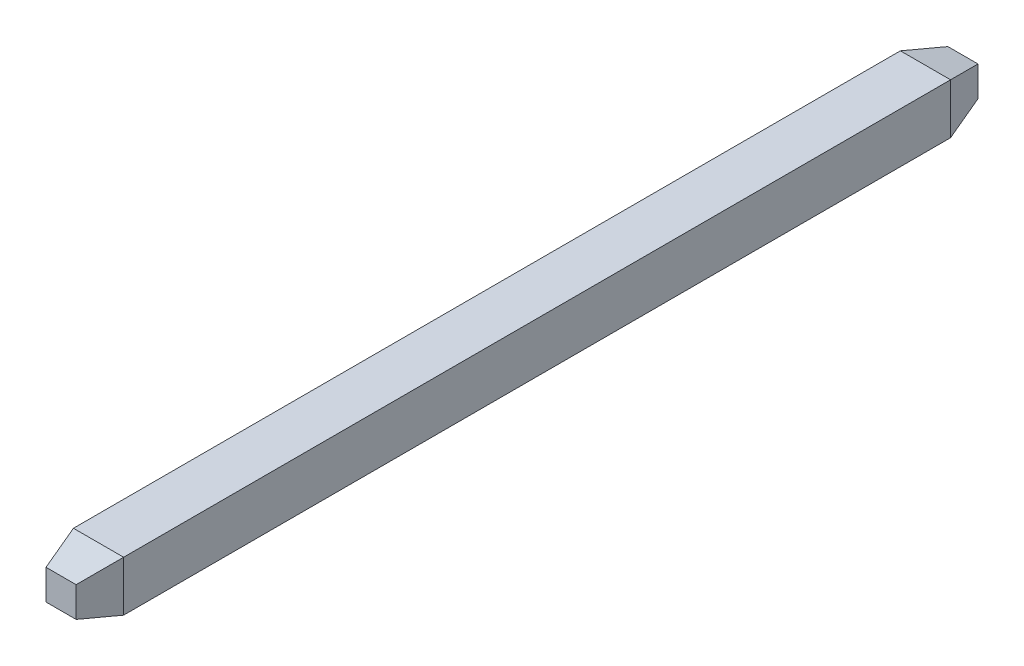
ISO-10303-21;
HEADER;
FILE_DESCRIPTION(('STEP AP214'),'2;1');
FILE_NAME('part.step','',(''),(''),'','','');
FILE_SCHEMA(('AUTOMOTIVE_DESIGN { 1 0 10303 214 1 1 1 1 }'));
ENDSEC;
DATA;
#1=APPLICATION_CONTEXT('core data for automotive mechanical design processes');
#2=APPLICATION_PROTOCOL_DEFINITION('international standard','automotive_design',2000,#1);
#3=PRODUCT_CONTEXT('',#1,'mechanical');
#4=PRODUCT('Part','Part','',(#3));
#5=PRODUCT_RELATED_PRODUCT_CATEGORY('part','',(#4));
#6=PRODUCT_DEFINITION_FORMATION('','',#4);
#7=PRODUCT_DEFINITION_CONTEXT('part definition',#1,'design');
#8=PRODUCT_DEFINITION('design','',#6,#7);
#9=PRODUCT_DEFINITION_SHAPE('','',#8);
#10=(LENGTH_UNIT() NAMED_UNIT(*) SI_UNIT(.MILLI.,.METRE.));
#11=(NAMED_UNIT(*) PLANE_ANGLE_UNIT() SI_UNIT($,.RADIAN.));
#12=(NAMED_UNIT(*) SI_UNIT($,.STERADIAN.) SOLID_ANGLE_UNIT());
#13=UNCERTAINTY_MEASURE_WITH_UNIT(LENGTH_MEASURE(1.E-05),#10,'distance_accuracy_value','');
#14=(GEOMETRIC_REPRESENTATION_CONTEXT(3) GLOBAL_UNCERTAINTY_ASSIGNED_CONTEXT((#13)) GLOBAL_UNIT_ASSIGNED_CONTEXT((#10,
#11,#12)) REPRESENTATION_CONTEXT('',''));
#15=CARTESIAN_POINT('',(0.,0.,0.));
#16=DIRECTION('',(0.,0.,1.));
#17=DIRECTION('',(1.,0.,0.));
#18=AXIS2_PLACEMENT_3D('',#15,#16,#17);
#19=CARTESIAN_POINT('',(8.62859499326237,-0.320000000000149,7.92229749663118));
#20=DIRECTION('',(0.,-0.965925826289069,0.25881904510252));
#21=DIRECTION('',(0.,-0.25881904510252,-0.965925826289069));
#22=AXIS2_PLACEMENT_3D('',#19,#20,#21);
#23=PLANE('',#22);
#24=DIRECTION('',(1.,0.,0.));
#25=VECTOR('',#24,1.);
#26=CARTESIAN_POINT('',(10.16,-0.192000000000149,8.4));
#27=LINE('',#26,#25);
#28=CARTESIAN_POINT('',(9.968,-0.192000000000148,8.4));
#29=VERTEX_POINT('',#28);
#30=CARTESIAN_POINT('',(10.352,-0.192000000000148,8.4));
#31=VERTEX_POINT('',#30);
#32=EDGE_CURVE('E20',#29,#31,#27,.T.);
#33=ORIENTED_EDGE('',*,*,#32,.F.);
#34=DIRECTION('',(0.250562807085732,0.250562807085729,0.93511312653103));
#35=VECTOR('',#34,1.);
#36=CARTESIAN_POINT('',(9.84,-0.320000000000149,7.92229749663118));
#37=LINE('',#36,#35);
#38=CARTESIAN_POINT('',(9.84,-0.320000000000149,7.92229749663118));
#39=VERTEX_POINT('',#38);
#40=EDGE_CURVE('E110',#39,#29,#37,.T.);
#41=ORIENTED_EDGE('',*,*,#40,.F.);
#42=DIRECTION('',(1.,0.,0.));
#43=VECTOR('',#42,1.);
#44=CARTESIAN_POINT('',(9.84,-0.320000000000149,7.92229749663118));
#45=LINE('',#44,#43);
#46=CARTESIAN_POINT('',(10.48,-0.320000000000148,7.92229749663118));
#47=VERTEX_POINT('',#46);
#48=EDGE_CURVE('E96',#47,#39,#45,.F.);
#49=ORIENTED_EDGE('',*,*,#48,.F.);
#50=DIRECTION('',(0.250562807085732,-0.25056280708573,-0.93511312653103));
#51=VECTOR('',#50,1.);
#52=CARTESIAN_POINT('',(10.352,-0.192000000000148,8.4));
#53=LINE('',#52,#51);
#54=EDGE_CURVE('E94',#31,#47,#53,.T.);
#55=ORIENTED_EDGE('',*,*,#54,.F.);
#56=EDGE_LOOP('',(#33,#41,#49,#55));
#57=FACE_BOUND('',#56,.T.);
#58=ADVANCED_FACE('F17',(#57),#23,.T.);
#59=CARTESIAN_POINT('',(8.62859499326237,-0.320000000000149,-2.62229749663118));
#60=DIRECTION('',(0.,0.965925826289068,0.258819045102521));
#61=DIRECTION('',(0.,-0.258819045102521,0.965925826289068));
#62=AXIS2_PLACEMENT_3D('',#59,#60,#61);
#63=PLANE('',#62);
#64=DIRECTION('',(0.250562807085732,0.250562807085729,-0.93511312653103));
#65=VECTOR('',#64,1.);
#66=CARTESIAN_POINT('',(9.84,-0.320000000000149,-2.62229749663118));
#67=LINE('',#66,#65);
#68=CARTESIAN_POINT('',(9.84,-0.320000000000149,-2.62229749663118));
#69=VERTEX_POINT('',#68);
#70=CARTESIAN_POINT('',(9.968,-0.192000000000148,-3.1));
#71=VERTEX_POINT('',#70);
#72=EDGE_CURVE('E113',#69,#71,#67,.T.);
#73=ORIENTED_EDGE('',*,*,#72,.T.);
#74=DIRECTION('',(1.,0.,0.));
#75=VECTOR('',#74,1.);
#76=CARTESIAN_POINT('',(10.16,-0.192000000000149,-3.1));
#77=LINE('',#76,#75);
#78=CARTESIAN_POINT('',(10.352,-0.192000000000148,-3.1));
#79=VERTEX_POINT('',#78);
#80=EDGE_CURVE('E79',#71,#79,#77,.T.);
#81=ORIENTED_EDGE('',*,*,#80,.T.);
#82=DIRECTION('',(0.250562807085732,-0.25056280708573,0.93511312653103));
#83=VECTOR('',#82,1.);
#84=CARTESIAN_POINT('',(10.352,-0.192000000000148,-3.1));
#85=LINE('',#84,#83);
#86=CARTESIAN_POINT('',(10.48,-0.320000000000148,-2.62229749663118));
#87=VERTEX_POINT('',#86);
#88=EDGE_CURVE('E108',#79,#87,#85,.T.);
#89=ORIENTED_EDGE('',*,*,#88,.T.);
#90=DIRECTION('',(1.,0.,0.));
#91=VECTOR('',#90,1.);
#92=CARTESIAN_POINT('',(9.84,-0.320000000000149,-2.62229749663118));
#93=LINE('',#92,#91);
#94=EDGE_CURVE('E118',#69,#87,#93,.T.);
#95=ORIENTED_EDGE('',*,*,#94,.F.);
#96=EDGE_LOOP('',(#73,#81,#89,#95));
#97=FACE_BOUND('',#96,.T.);
#98=ADVANCED_FACE('F281',(#97),#63,.F.);
#99=CARTESIAN_POINT('',(10.16,-1.49392204292845E-13,8.4));
#100=DIRECTION('',(0.,0.,1.));
#101=DIRECTION('',(1.,0.,0.));
#102=AXIS2_PLACEMENT_3D('',#99,#100,#101);
#103=PLANE('',#102);
#104=ORIENTED_EDGE('',*,*,#32,.T.);
#105=DIRECTION('',(0.,1.,0.));
#106=VECTOR('',#105,1.);
#107=CARTESIAN_POINT('',(10.352,-1.53140500673778,8.4));
#108=LINE('',#107,#106);
#109=CARTESIAN_POINT('',(10.352,0.191999999999852,8.4));
#110=VERTEX_POINT('',#109);
#111=EDGE_CURVE('E88',#110,#31,#108,.F.);
#112=ORIENTED_EDGE('',*,*,#111,.F.);
#113=DIRECTION('',(1.,0.,0.));
#114=VECTOR('',#113,1.);
#115=CARTESIAN_POINT('',(11.6914050067376,0.19199999999985,8.4));
#116=LINE('',#115,#114);
#117=CARTESIAN_POINT('',(9.968,0.191999999999851,8.4));
#118=VERTEX_POINT('',#117);
#119=EDGE_CURVE('E124',#118,#110,#116,.T.);
#120=ORIENTED_EDGE('',*,*,#119,.F.);
#121=DIRECTION('',(0.,1.,0.));
#122=VECTOR('',#121,1.);
#123=CARTESIAN_POINT('',(9.968,1.53140500673748,8.4));
#124=LINE('',#123,#122);
#125=EDGE_CURVE('E90',#29,#118,#124,.T.);
#126=ORIENTED_EDGE('',*,*,#125,.F.);
#127=EDGE_LOOP('',(#104,#112,#120,#126));
#128=FACE_BOUND('',#127,.T.);
#129=ADVANCED_FACE('F85',(#128),#103,.T.);
#130=CARTESIAN_POINT('',(10.48,-1.53140500673778,7.92229749663118));
#131=DIRECTION('',(0.965925826289069,0.,0.25881904510252));
#132=DIRECTION('',(0.25881904510252,0.,-0.965925826289069));
#133=AXIS2_PLACEMENT_3D('',#130,#131,#132);
#134=PLANE('',#133);
#135=ORIENTED_EDGE('',*,*,#111,.T.);
#136=ORIENTED_EDGE('',*,*,#54,.T.);
#137=DIRECTION('',(0.,1.,0.));
#138=VECTOR('',#137,1.);
#139=CARTESIAN_POINT('',(10.48,-0.320000000000148,7.92229749663118));
#140=LINE('',#139,#138);
#141=CARTESIAN_POINT('',(10.48,0.319999999999851,7.92229749663118));
#142=VERTEX_POINT('',#141);
#143=EDGE_CURVE('E127',#142,#47,#140,.F.);
#144=ORIENTED_EDGE('',*,*,#143,.F.);
#145=DIRECTION('',(0.250562807085732,0.250562807085731,-0.93511312653103));
#146=VECTOR('',#145,1.);
#147=CARTESIAN_POINT('',(10.352,0.191999999999851,8.4));
#148=LINE('',#147,#146);
#149=EDGE_CURVE('E102',#110,#142,#148,.T.);
#150=ORIENTED_EDGE('',*,*,#149,.F.);
#151=EDGE_LOOP('',(#135,#136,#144,#150));
#152=FACE_BOUND('',#151,.T.);
#153=ADVANCED_FACE('F100',(#152),#134,.T.);
#154=CARTESIAN_POINT('',(10.16,-1.49392204292845E-13,-3.1));
#155=DIRECTION('',(0.,0.,1.));
#156=DIRECTION('',(1.,0.,0.));
#157=AXIS2_PLACEMENT_3D('',#154,#155,#156);
#158=PLANE('',#157);
#159=DIRECTION('',(0.,1.,0.));
#160=VECTOR('',#159,1.);
#161=CARTESIAN_POINT('',(10.352,-1.53140500673778,-3.1));
#162=LINE('',#161,#160);
#163=CARTESIAN_POINT('',(10.352,0.191999999999852,-3.1));
#164=VERTEX_POINT('',#163);
#165=EDGE_CURVE('E106',#164,#79,#162,.F.);
#166=ORIENTED_EDGE('',*,*,#165,.T.);
#167=ORIENTED_EDGE('',*,*,#80,.F.);
#168=DIRECTION('',(0.,1.,0.));
#169=VECTOR('',#168,1.);
#170=CARTESIAN_POINT('',(9.968,1.53140500673748,-3.1));
#171=LINE('',#170,#169);
#172=CARTESIAN_POINT('',(9.968,0.191999999999851,-3.1));
#173=VERTEX_POINT('',#172);
#174=EDGE_CURVE('E115',#71,#173,#171,.T.);
#175=ORIENTED_EDGE('',*,*,#174,.T.);
#176=DIRECTION('',(1.,0.,0.));
#177=VECTOR('',#176,1.);
#178=CARTESIAN_POINT('',(11.6914050067376,0.19199999999985,-3.1));
#179=LINE('',#178,#177);
#180=EDGE_CURVE('E138',#173,#164,#179,.T.);
#181=ORIENTED_EDGE('',*,*,#180,.T.);
#182=EDGE_LOOP('',(#166,#167,#175,#181));
#183=FACE_BOUND('',#182,.T.);
#184=ADVANCED_FACE('F257',(#183),#158,.F.);
#185=CARTESIAN_POINT('',(10.48,-1.53140500673778,-2.62229749663118));
#186=DIRECTION('',(-0.965925826289068,0.,0.258819045102521));
#187=DIRECTION('',(0.258819045102521,0.,0.965925826289068));
#188=AXIS2_PLACEMENT_3D('',#185,#186,#187);
#189=PLANE('',#188);
#190=ORIENTED_EDGE('',*,*,#88,.F.);
#191=ORIENTED_EDGE('',*,*,#165,.F.);
#192=DIRECTION('',(0.250562807085732,0.250562807085732,0.935113126531029));
#193=VECTOR('',#192,1.);
#194=CARTESIAN_POINT('',(10.352,0.19199999999985,-3.1));
#195=LINE('',#194,#193);
#196=CARTESIAN_POINT('',(10.48,0.319999999999851,-2.62229749663118));
#197=VERTEX_POINT('',#196);
#198=EDGE_CURVE('E140',#164,#197,#195,.T.);
#199=ORIENTED_EDGE('',*,*,#198,.T.);
#200=DIRECTION('',(0.,1.,0.));
#201=VECTOR('',#200,1.);
#202=CARTESIAN_POINT('',(10.48,-0.320000000000148,-2.62229749663118));
#203=LINE('',#202,#201);
#204=EDGE_CURVE('E133',#87,#197,#203,.T.);
#205=ORIENTED_EDGE('',*,*,#204,.F.);
#206=EDGE_LOOP('',(#190,#191,#199,#205));
#207=FACE_BOUND('',#206,.T.);
#208=ADVANCED_FACE('F249',(#207),#189,.F.);
#209=CARTESIAN_POINT('',(9.84,1.53140500673748,7.92229749663118));
#210=DIRECTION('',(-0.965925826289069,0.,0.25881904510252));
#211=DIRECTION('',(0.25881904510252,0.,0.965925826289069));
#212=AXIS2_PLACEMENT_3D('',#209,#210,#211);
#213=PLANE('',#212);
#214=ORIENTED_EDGE('',*,*,#125,.T.);
#215=DIRECTION('',(0.250562807085729,-0.250562807085731,0.93511312653103));
#216=VECTOR('',#215,1.);
#217=CARTESIAN_POINT('',(9.84,0.319999999999852,7.92229749663118));
#218=LINE('',#217,#216);
#219=CARTESIAN_POINT('',(9.84,0.319999999999851,7.92229749663118));
#220=VERTEX_POINT('',#219);
#221=EDGE_CURVE('E121',#220,#118,#218,.T.);
#222=ORIENTED_EDGE('',*,*,#221,.F.);
#223=DIRECTION('',(0.,-1.,0.));
#224=VECTOR('',#223,1.);
#225=CARTESIAN_POINT('',(9.84,0.319999999999852,7.92229749663118));
#226=LINE('',#225,#224);
#227=EDGE_CURVE('E142',#39,#220,#226,.F.);
#228=ORIENTED_EDGE('',*,*,#227,.F.);
#229=ORIENTED_EDGE('',*,*,#40,.T.);
#230=EDGE_LOOP('',(#214,#222,#228,#229));
#231=FACE_BOUND('',#230,.T.);
#232=ADVANCED_FACE('F171',(#231),#213,.T.);
#233=CARTESIAN_POINT('',(9.84,1.53140500673748,-2.62229749663118));
#234=DIRECTION('',(0.965925826289068,0.,0.258819045102521));
#235=DIRECTION('',(0.258819045102521,0.,-0.965925826289068));
#236=AXIS2_PLACEMENT_3D('',#233,#234,#235);
#237=PLANE('',#236);
#238=DIRECTION('',(0.250562807085729,-0.250562807085732,-0.93511312653103));
#239=VECTOR('',#238,1.);
#240=CARTESIAN_POINT('',(9.84,0.319999999999852,-2.62229749663118));
#241=LINE('',#240,#239);
#242=CARTESIAN_POINT('',(9.84,0.319999999999852,-2.62229749663118));
#243=VERTEX_POINT('',#242);
#244=EDGE_CURVE('E136',#243,#173,#241,.T.);
#245=ORIENTED_EDGE('',*,*,#244,.T.);
#246=ORIENTED_EDGE('',*,*,#174,.F.);
#247=ORIENTED_EDGE('',*,*,#72,.F.);
#248=DIRECTION('',(0.,-1.,0.));
#249=VECTOR('',#248,1.);
#250=CARTESIAN_POINT('',(9.84,0.319999999999852,-2.62229749663118));
#251=LINE('',#250,#249);
#252=EDGE_CURVE('E35',#243,#69,#251,.T.);
#253=ORIENTED_EDGE('',*,*,#252,.F.);
#254=EDGE_LOOP('',(#245,#246,#247,#253));
#255=FACE_BOUND('',#254,.T.);
#256=ADVANCED_FACE('F188',(#255),#237,.F.);
#257=CARTESIAN_POINT('',(9.84,-0.320000000000149,-3.1));
#258=DIRECTION('',(0.,-1.,0.));
#259=DIRECTION('',(1.,0.,0.));
#260=AXIS2_PLACEMENT_3D('',#257,#258,#259);
#261=PLANE('',#260);
#262=ORIENTED_EDGE('',*,*,#94,.T.);
#263=DIRECTION('',(0.,0.,1.));
#264=VECTOR('',#263,1.);
#265=CARTESIAN_POINT('',(10.48,-0.320000000000148,-3.1));
#266=LINE('',#265,#264);
#267=EDGE_CURVE('E130',#47,#87,#266,.F.);
#268=ORIENTED_EDGE('',*,*,#267,.F.);
#269=ORIENTED_EDGE('',*,*,#48,.T.);
#270=DIRECTION('',(0.,0.,1.));
#271=VECTOR('',#270,1.);
#272=CARTESIAN_POINT('',(9.84,-0.320000000000149,-3.1));
#273=LINE('',#272,#271);
#274=EDGE_CURVE('E146',#69,#39,#273,.T.);
#275=ORIENTED_EDGE('',*,*,#274,.F.);
#276=EDGE_LOOP('',(#262,#268,#269,#275));
#277=FACE_BOUND('',#276,.T.);
#278=ADVANCED_FACE('F174',(#277),#261,.T.);
#279=CARTESIAN_POINT('',(11.6914050067376,0.319999999999851,7.92229749663118));
#280=DIRECTION('',(0.,0.965925826289069,0.25881904510252));
#281=DIRECTION('',(0.,-0.25881904510252,0.965925826289069));
#282=AXIS2_PLACEMENT_3D('',#279,#280,#281);
#283=PLANE('',#282);
#284=ORIENTED_EDGE('',*,*,#119,.T.);
#285=ORIENTED_EDGE('',*,*,#149,.T.);
#286=DIRECTION('',(-1.,0.,0.));
#287=VECTOR('',#286,1.);
#288=CARTESIAN_POINT('',(10.48,0.319999999999851,7.92229749663118));
#289=LINE('',#288,#287);
#290=EDGE_CURVE('E149',#220,#142,#289,.F.);
#291=ORIENTED_EDGE('',*,*,#290,.F.);
#292=ORIENTED_EDGE('',*,*,#221,.T.);
#293=EDGE_LOOP('',(#284,#285,#291,#292));
#294=FACE_BOUND('',#293,.T.);
#295=ADVANCED_FACE('F179',(#294),#283,.T.);
#296=CARTESIAN_POINT('',(10.48,-0.320000000000148,-3.1));
#297=DIRECTION('',(1.,0.,0.));
#298=DIRECTION('',(0.,1.,0.));
#299=AXIS2_PLACEMENT_3D('',#296,#297,#298);
#300=PLANE('',#299);
#301=ORIENTED_EDGE('',*,*,#204,.T.);
#302=DIRECTION('',(0.,0.,1.));
#303=VECTOR('',#302,1.);
#304=CARTESIAN_POINT('',(10.48,0.319999999999851,-3.1));
#305=LINE('',#304,#303);
#306=EDGE_CURVE('E152',#142,#197,#305,.F.);
#307=ORIENTED_EDGE('',*,*,#306,.F.);
#308=ORIENTED_EDGE('',*,*,#143,.T.);
#309=ORIENTED_EDGE('',*,*,#267,.T.);
#310=EDGE_LOOP('',(#301,#307,#308,#309));
#311=FACE_BOUND('',#310,.T.);
#312=ADVANCED_FACE('F177',(#311),#300,.T.);
#313=CARTESIAN_POINT('',(11.6914050067376,0.319999999999851,-2.62229749663118));
#314=DIRECTION('',(0.,-0.965925826289068,0.258819045102521));
#315=DIRECTION('',(0.,-0.258819045102521,-0.965925826289068));
#316=AXIS2_PLACEMENT_3D('',#313,#314,#315);
#317=PLANE('',#316);
#318=ORIENTED_EDGE('',*,*,#198,.F.);
#319=ORIENTED_EDGE('',*,*,#180,.F.);
#320=ORIENTED_EDGE('',*,*,#244,.F.);
#321=DIRECTION('',(-1.,0.,0.));
#322=VECTOR('',#321,1.);
#323=CARTESIAN_POINT('',(10.48,0.319999999999851,-2.62229749663118));
#324=LINE('',#323,#322);
#325=EDGE_CURVE('E26',#197,#243,#324,.T.);
#326=ORIENTED_EDGE('',*,*,#325,.F.);
#327=EDGE_LOOP('',(#318,#319,#320,#326));
#328=FACE_BOUND('',#327,.T.);
#329=ADVANCED_FACE('F163',(#328),#317,.F.);
#330=CARTESIAN_POINT('',(9.84,0.319999999999852,-3.1));
#331=DIRECTION('',(-1.,0.,0.));
#332=DIRECTION('',(0.,-1.,0.));
#333=AXIS2_PLACEMENT_3D('',#330,#331,#332);
#334=PLANE('',#333);
#335=ORIENTED_EDGE('',*,*,#252,.T.);
#336=ORIENTED_EDGE('',*,*,#274,.T.);
#337=ORIENTED_EDGE('',*,*,#227,.T.);
#338=DIRECTION('',(0.,0.,1.));
#339=VECTOR('',#338,1.);
#340=CARTESIAN_POINT('',(9.84,0.319999999999851,-3.1));
#341=LINE('',#340,#339);
#342=EDGE_CURVE('E11',#243,#220,#341,.T.);
#343=ORIENTED_EDGE('',*,*,#342,.F.);
#344=EDGE_LOOP('',(#335,#336,#337,#343));
#345=FACE_BOUND('',#344,.T.);
#346=ADVANCED_FACE('F167',(#345),#334,.T.);
#347=CARTESIAN_POINT('',(10.48,0.319999999999851,-3.1));
#348=DIRECTION('',(0.,1.,0.));
#349=DIRECTION('',(-1.,0.,0.));
#350=AXIS2_PLACEMENT_3D('',#347,#348,#349);
#351=PLANE('',#350);
#352=ORIENTED_EDGE('',*,*,#325,.T.);
#353=ORIENTED_EDGE('',*,*,#342,.T.);
#354=ORIENTED_EDGE('',*,*,#290,.T.);
#355=ORIENTED_EDGE('',*,*,#306,.T.);
#356=EDGE_LOOP('',(#352,#353,#354,#355));
#357=FACE_BOUND('',#356,.T.);
#358=ADVANCED_FACE('F158',(#357),#351,.T.);
#359=CLOSED_SHELL('',(#58,#98,#129,#153,#184,#208,#232,#256,#278,#295,#312,#329,#346,#358));
#360=MANIFOLD_SOLID_BREP('B1',#359);
#361=ADVANCED_BREP_SHAPE_REPRESENTATION('',(#18,#360),#14);
#362=SHAPE_DEFINITION_REPRESENTATION(#9,#361);
ENDSEC;
END-ISO-10303-21;
